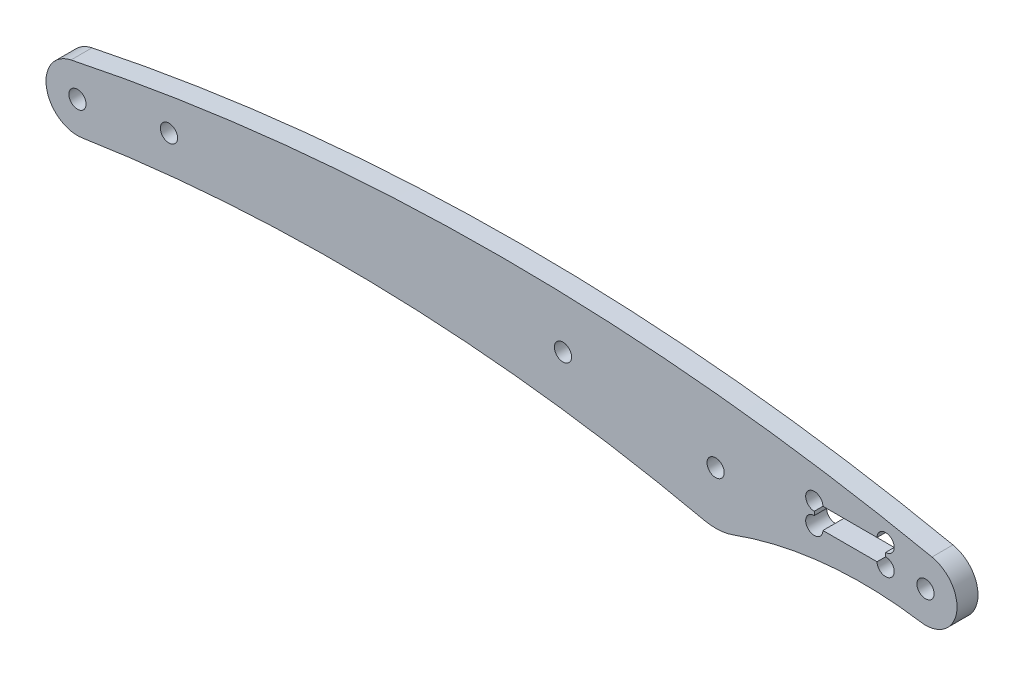
ISO-10303-21;
HEADER;
FILE_DESCRIPTION(('STEP AP214'),'2;1');
FILE_NAME('part.step','',(''),(''),'','','');
FILE_SCHEMA(('AUTOMOTIVE_DESIGN { 1 0 10303 214 1 1 1 1 }'));
ENDSEC;
DATA;
#1=APPLICATION_CONTEXT('core data for automotive mechanical design processes');
#2=APPLICATION_PROTOCOL_DEFINITION('international standard','automotive_design',2000,#1);
#3=PRODUCT_CONTEXT('',#1,'mechanical');
#4=PRODUCT('Part','Part','',(#3));
#5=PRODUCT_RELATED_PRODUCT_CATEGORY('part','',(#4));
#6=PRODUCT_DEFINITION_FORMATION('','',#4);
#7=PRODUCT_DEFINITION_CONTEXT('part definition',#1,'design');
#8=PRODUCT_DEFINITION('design','',#6,#7);
#9=PRODUCT_DEFINITION_SHAPE('','',#8);
#10=(LENGTH_UNIT() NAMED_UNIT(*) SI_UNIT(.MILLI.,.METRE.));
#11=(NAMED_UNIT(*) PLANE_ANGLE_UNIT() SI_UNIT($,.RADIAN.));
#12=(NAMED_UNIT(*) SI_UNIT($,.STERADIAN.) SOLID_ANGLE_UNIT());
#13=UNCERTAINTY_MEASURE_WITH_UNIT(LENGTH_MEASURE(1.E-05),#10,'distance_accuracy_value','');
#14=(GEOMETRIC_REPRESENTATION_CONTEXT(3) GLOBAL_UNCERTAINTY_ASSIGNED_CONTEXT((#13)) GLOBAL_UNIT_ASSIGNED_CONTEXT((#10,
#11,#12)) REPRESENTATION_CONTEXT('',''));
#15=CARTESIAN_POINT('',(0.,0.,0.));
#16=DIRECTION('',(0.,0.,1.));
#17=DIRECTION('',(1.,0.,0.));
#18=AXIS2_PLACEMENT_3D('',#15,#16,#17);
#19=CARTESIAN_POINT('',(31.2565789473684,-201.33824468418,5.));
#20=DIRECTION('',(0.,0.,1.));
#21=DIRECTION('',(1.,0.,0.));
#22=AXIS2_PLACEMENT_3D('',#19,#20,#21);
#23=PLANE('',#22);
#24=CARTESIAN_POINT('',(192.5,4.82060107798254,5.));
#25=DIRECTION('',(0.,0.,1.));
#26=DIRECTION('',(1.,0.,0.));
#27=AXIS2_PLACEMENT_3D('',#24,#25,#26);
#28=CIRCLE('',#27,2.04999999999999);
#29=CARTESIAN_POINT('',(192.5,2.77060107798255,5.));
#30=VERTEX_POINT('',#29);
#31=CARTESIAN_POINT('',(190.45,4.82060107798254,5.));
#32=VERTEX_POINT('',#31);
#33=EDGE_CURVE('E553',#30,#32,#28,.T.);
#34=ORIENTED_EDGE('',*,*,#33,.F.);
#35=DIRECTION('',(0.,1.,0.));
#36=VECTOR('',#35,1.);
#37=CARTESIAN_POINT('',(192.5,-0.179398922017457,5.));
#38=LINE('',#37,#36);
#39=CARTESIAN_POINT('',(192.5,1.87060107798254,5.));
#40=VERTEX_POINT('',#39);
#41=EDGE_CURVE('E176',#40,#30,#38,.T.);
#42=ORIENTED_EDGE('',*,*,#41,.F.);
#43=CARTESIAN_POINT('',(192.5,-0.179398922017457,5.));
#44=DIRECTION('',(0.,0.,1.));
#45=DIRECTION('',(1.,0.,0.));
#46=AXIS2_PLACEMENT_3D('',#43,#44,#45);
#47=CIRCLE('',#46,2.04999999999999);
#48=CARTESIAN_POINT('',(190.45,-0.179398922017457,5.));
#49=VERTEX_POINT('',#48);
#50=EDGE_CURVE('E544',#49,#40,#47,.T.);
#51=ORIENTED_EDGE('',*,*,#50,.F.);
#52=DIRECTION('',(1.,0.,0.));
#53=VECTOR('',#52,1.);
#54=CARTESIAN_POINT('',(175.5,-0.179398922017457,5.));
#55=LINE('',#54,#53);
#56=CARTESIAN_POINT('',(177.55,-0.179398922017457,5.));
#57=VERTEX_POINT('',#56);
#58=EDGE_CURVE('E167',#57,#49,#55,.T.);
#59=ORIENTED_EDGE('',*,*,#58,.F.);
#60=CARTESIAN_POINT('',(175.5,-0.17939892201746,5.));
#61=DIRECTION('',(0.,0.,1.));
#62=DIRECTION('',(1.,0.,0.));
#63=AXIS2_PLACEMENT_3D('',#60,#61,#62);
#64=CIRCLE('',#63,2.04999999999999);
#65=CARTESIAN_POINT('',(175.5,1.87060107798253,5.));
#66=VERTEX_POINT('',#65);
#67=EDGE_CURVE('E149',#66,#57,#64,.T.);
#68=ORIENTED_EDGE('',*,*,#67,.F.);
#69=DIRECTION('',(0.,-1.,0.));
#70=VECTOR('',#69,1.);
#71=CARTESIAN_POINT('',(175.5,-0.179398922017457,5.));
#72=LINE('',#71,#70);
#73=CARTESIAN_POINT('',(175.5,2.77060107798255,5.));
#74=VERTEX_POINT('',#73);
#75=EDGE_CURVE('E159',#74,#66,#72,.T.);
#76=ORIENTED_EDGE('',*,*,#75,.F.);
#77=CARTESIAN_POINT('',(175.5,4.82060107798254,5.));
#78=DIRECTION('',(0.,0.,1.));
#79=DIRECTION('',(1.,0.,0.));
#80=AXIS2_PLACEMENT_3D('',#77,#78,#79);
#81=CIRCLE('',#80,2.04999999999999);
#82=CARTESIAN_POINT('',(177.55,4.82060107798254,5.));
#83=VERTEX_POINT('',#82);
#84=EDGE_CURVE('E529',#83,#74,#81,.T.);
#85=ORIENTED_EDGE('',*,*,#84,.F.);
#86=DIRECTION('',(-1.,0.,0.));
#87=VECTOR('',#86,1.);
#88=CARTESIAN_POINT('',(175.5,4.82060107798254,5.));
#89=LINE('',#88,#87);
#90=EDGE_CURVE('E179',#32,#83,#89,.T.);
#91=ORIENTED_EDGE('',*,*,#90,.F.);
#92=EDGE_LOOP('',(#34,#42,#51,#59,#68,#76,#85,#91));
#93=FACE_BOUND('',#92,.T.);
#94=CARTESIAN_POINT('',(115.643522850796,5.67392586663605,5.));
#95=DIRECTION('',(0.,0.,1.));
#96=DIRECTION('',(1.,0.,0.));
#97=AXIS2_PLACEMENT_3D('',#94,#95,#96);
#98=CIRCLE('',#97,2.04999999999999);
#99=CARTESIAN_POINT('',(117.693522850796,5.67392586663605,5.));
#100=VERTEX_POINT('',#99);
#101=EDGE_CURVE('E184',#100,#100,#98,.T.);
#102=ORIENTED_EDGE('',*,*,#101,.F.);
#103=EDGE_LOOP('',(#102));
#104=FACE_BOUND('',#103,.T.);
#105=CARTESIAN_POINT('',(21.7926473493923,3.92392586663605,5.));
#106=DIRECTION('',(0.,0.,1.));
#107=DIRECTION('',(1.,0.,0.));
#108=AXIS2_PLACEMENT_3D('',#105,#106,#107);
#109=CIRCLE('',#108,2.05);
#110=CARTESIAN_POINT('',(23.8426473493923,3.92392586663605,5.));
#111=VERTEX_POINT('',#110);
#112=EDGE_CURVE('E187',#111,#111,#109,.T.);
#113=ORIENTED_EDGE('',*,*,#112,.F.);
#114=EDGE_LOOP('',(#113));
#115=FACE_BOUND('',#114,.T.);
#116=CARTESIAN_POINT('',(202.,0.,5.));
#117=DIRECTION('',(0.,0.,1.));
#118=DIRECTION('',(1.,0.,0.));
#119=AXIS2_PLACEMENT_3D('',#116,#117,#118);
#120=CIRCLE('',#119,2.04999999999999);
#121=CARTESIAN_POINT('',(204.05,0.,5.));
#122=VERTEX_POINT('',#121);
#123=EDGE_CURVE('E198',#122,#122,#120,.T.);
#124=ORIENTED_EDGE('',*,*,#123,.F.);
#125=EDGE_LOOP('',(#124));
#126=FACE_BOUND('',#125,.T.);
#127=CARTESIAN_POINT('',(62.5131578947368,-402.676489368361,5.));
#128=DIRECTION('',(0.,0.,-1.));
#129=DIRECTION('',(1.,0.,0.));
#130=AXIS2_PLACEMENT_3D('',#127,#128,#129);
#131=CIRCLE('',#130,400.);
#132=CARTESIAN_POINT('',(1.15054891830802,-7.4112237307059,5.));
#133=VERTEX_POINT('',#132);
#134=CARTESIAN_POINT('',(149.288277511962,-12.2023178596472,5.));
#135=VERTEX_POINT('',#134);
#136=EDGE_CURVE('E210',#133,#135,#131,.T.);
#137=ORIENTED_EDGE('',*,*,#136,.T.);
#138=CARTESIAN_POINT('',(152.,0.,5.));
#139=DIRECTION('',(0.,0.,1.));
#140=DIRECTION('',(1.,0.,0.));
#141=AXIS2_PLACEMENT_3D('',#138,#139,#140);
#142=CIRCLE('',#141,12.4999999999999);
#143=CARTESIAN_POINT('',(156.268292682927,-11.7486883341449,5.));
#144=VERTEX_POINT('',#143);
#145=EDGE_CURVE('E213',#135,#144,#142,.T.);
#146=ORIENTED_EDGE('',*,*,#145,.T.);
#147=CARTESIAN_POINT('',(187.,-96.3392443399884,5.));
#148=DIRECTION('',(0.,0.,-1.));
#149=DIRECTION('',(1.,0.,0.));
#150=AXIS2_PLACEMENT_3D('',#147,#148,#149);
#151=CIRCLE('',#150,90.);
#152=CARTESIAN_POINT('',(200.846153846154,-7.4107111030761,5.));
#153=VERTEX_POINT('',#152);
#154=EDGE_CURVE('E216',#144,#153,#151,.T.);
#155=ORIENTED_EDGE('',*,*,#154,.T.);
#156=CARTESIAN_POINT('',(202.,0.,5.));
#157=DIRECTION('',(0.,0.,1.));
#158=DIRECTION('',(1.,0.,0.));
#159=AXIS2_PLACEMENT_3D('',#156,#157,#158);
#160=CIRCLE('',#159,7.50000000000006);
#161=CARTESIAN_POINT('',(203.53807106599,7.34059516633123,5.));
#162=VERTEX_POINT('',#161);
#163=EDGE_CURVE('E218',#153,#162,#160,.T.);
#164=ORIENTED_EDGE('',*,*,#163,.T.);
#165=CARTESIAN_POINT('',(101.000000000001,-482.032415922415,5.));
#166=DIRECTION('',(0.,0.,1.));
#167=DIRECTION('',(1.,0.,0.));
#168=AXIS2_PLACEMENT_3D('',#165,#166,#167);
#169=CIRCLE('',#168,500.);
#170=CARTESIAN_POINT('',(-1.53807106598983,7.34059516633106,5.));
#171=VERTEX_POINT('',#170);
#172=EDGE_CURVE('E220',#162,#171,#169,.T.);
#173=ORIENTED_EDGE('',*,*,#172,.T.);
#174=CARTESIAN_POINT('',(0.,0.,5.));
#175=DIRECTION('',(0.,0.,1.));
#176=DIRECTION('',(1.,0.,0.));
#177=AXIS2_PLACEMENT_3D('',#174,#175,#176);
#178=CIRCLE('',#177,7.49999999999986);
#179=EDGE_CURVE('E222',#171,#133,#178,.T.);
#180=ORIENTED_EDGE('',*,*,#179,.T.);
#181=EDGE_LOOP('',(#137,#146,#155,#164,#173,#180));
#182=FACE_BOUND('',#181,.T.);
#183=CARTESIAN_POINT('',(0.,0.,5.));
#184=DIRECTION('',(0.,0.,1.));
#185=DIRECTION('',(1.,0.,0.));
#186=AXIS2_PLACEMENT_3D('',#183,#184,#185);
#187=CIRCLE('',#186,2.05);
#188=CARTESIAN_POINT('',(2.05,0.,5.));
#189=VERTEX_POINT('',#188);
#190=EDGE_CURVE('E204',#189,#189,#187,.T.);
#191=ORIENTED_EDGE('',*,*,#190,.F.);
#192=EDGE_LOOP('',(#191));
#193=FACE_BOUND('',#192,.T.);
#194=CARTESIAN_POINT('',(152.,0.,5.));
#195=DIRECTION('',(0.,0.,1.));
#196=DIRECTION('',(1.,0.,0.));
#197=AXIS2_PLACEMENT_3D('',#194,#195,#196);
#198=CIRCLE('',#197,2.04999999999999);
#199=CARTESIAN_POINT('',(154.05,0.,5.));
#200=VERTEX_POINT('',#199);
#201=EDGE_CURVE('E191',#200,#200,#198,.T.);
#202=ORIENTED_EDGE('',*,*,#201,.F.);
#203=EDGE_LOOP('',(#202));
#204=FACE_BOUND('',#203,.T.);
#205=ADVANCED_FACE('F36',(#93,#104,#115,#126,#182,#193,#204),#23,.T.);
#206=CARTESIAN_POINT('',(31.2565789473684,-201.33824468418,0.));
#207=DIRECTION('',(0.,0.,1.));
#208=DIRECTION('',(1.,0.,0.));
#209=AXIS2_PLACEMENT_3D('',#206,#207,#208);
#210=PLANE('',#209);
#211=DIRECTION('',(0.,-1.,0.));
#212=VECTOR('',#211,1.);
#213=CARTESIAN_POINT('',(192.5,-0.179398922017457,0.));
#214=LINE('',#213,#212);
#215=CARTESIAN_POINT('',(192.5,2.77060107798255,0.));
#216=VERTEX_POINT('',#215);
#217=CARTESIAN_POINT('',(192.5,1.87060107798254,0.));
#218=VERTEX_POINT('',#217);
#219=EDGE_CURVE('E170',#216,#218,#214,.T.);
#220=ORIENTED_EDGE('',*,*,#219,.F.);
#221=CARTESIAN_POINT('',(192.5,4.82060107798254,0.));
#222=DIRECTION('',(0.,0.,1.));
#223=DIRECTION('',(1.,0.,0.));
#224=AXIS2_PLACEMENT_3D('',#221,#222,#223);
#225=CIRCLE('',#224,2.04999999999999);
#226=CARTESIAN_POINT('',(190.45,4.82060107798254,0.));
#227=VERTEX_POINT('',#226);
#228=EDGE_CURVE('E61',#227,#216,#225,.F.);
#229=ORIENTED_EDGE('',*,*,#228,.F.);
#230=DIRECTION('',(1.,0.,0.));
#231=VECTOR('',#230,1.);
#232=CARTESIAN_POINT('',(175.5,4.82060107798254,0.));
#233=LINE('',#232,#231);
#234=CARTESIAN_POINT('',(177.55,4.82060107798254,0.));
#235=VERTEX_POINT('',#234);
#236=EDGE_CURVE('E165',#235,#227,#233,.T.);
#237=ORIENTED_EDGE('',*,*,#236,.F.);
#238=CARTESIAN_POINT('',(175.5,4.82060107798254,0.));
#239=DIRECTION('',(0.,0.,1.));
#240=DIRECTION('',(1.,0.,0.));
#241=AXIS2_PLACEMENT_3D('',#238,#239,#240);
#242=CIRCLE('',#241,2.04999999999999);
#243=CARTESIAN_POINT('',(175.5,2.77060107798255,0.));
#244=VERTEX_POINT('',#243);
#245=EDGE_CURVE('E53',#244,#235,#242,.F.);
#246=ORIENTED_EDGE('',*,*,#245,.F.);
#247=DIRECTION('',(0.,1.,0.));
#248=VECTOR('',#247,1.);
#249=CARTESIAN_POINT('',(175.5,-0.179398922017457,0.));
#250=LINE('',#249,#248);
#251=CARTESIAN_POINT('',(175.5,1.87060107798253,0.));
#252=VERTEX_POINT('',#251);
#253=EDGE_CURVE('E157',#252,#244,#250,.T.);
#254=ORIENTED_EDGE('',*,*,#253,.F.);
#255=CARTESIAN_POINT('',(175.5,-0.17939892201746,0.));
#256=DIRECTION('',(0.,0.,1.));
#257=DIRECTION('',(1.,0.,0.));
#258=AXIS2_PLACEMENT_3D('',#255,#256,#257);
#259=CIRCLE('',#258,2.04999999999999);
#260=CARTESIAN_POINT('',(177.55,-0.179398922017457,0.));
#261=VERTEX_POINT('',#260);
#262=EDGE_CURVE('E138',#261,#252,#259,.F.);
#263=ORIENTED_EDGE('',*,*,#262,.F.);
#264=DIRECTION('',(-1.,0.,0.));
#265=VECTOR('',#264,1.);
#266=CARTESIAN_POINT('',(175.5,-0.179398922017457,0.));
#267=LINE('',#266,#265);
#268=CARTESIAN_POINT('',(190.45,-0.179398922017457,0.));
#269=VERTEX_POINT('',#268);
#270=EDGE_CURVE('E182',#269,#261,#267,.T.);
#271=ORIENTED_EDGE('',*,*,#270,.F.);
#272=CARTESIAN_POINT('',(192.5,-0.179398922017457,0.));
#273=DIRECTION('',(0.,0.,1.));
#274=DIRECTION('',(1.,0.,0.));
#275=AXIS2_PLACEMENT_3D('',#272,#273,#274);
#276=CIRCLE('',#275,2.04999999999999);
#277=EDGE_CURVE('E542',#218,#269,#276,.F.);
#278=ORIENTED_EDGE('',*,*,#277,.F.);
#279=EDGE_LOOP('',(#220,#229,#237,#246,#254,#263,#271,#278));
#280=FACE_BOUND('',#279,.T.);
#281=CARTESIAN_POINT('',(115.643522850796,5.67392586663605,0.));
#282=DIRECTION('',(0.,0.,1.));
#283=DIRECTION('',(1.,0.,0.));
#284=AXIS2_PLACEMENT_3D('',#281,#282,#283);
#285=CIRCLE('',#284,2.04999999999999);
#286=CARTESIAN_POINT('',(117.693522850796,5.67392586663605,0.));
#287=VERTEX_POINT('',#286);
#288=EDGE_CURVE('E40',#287,#287,#285,.T.);
#289=ORIENTED_EDGE('',*,*,#288,.T.);
#290=EDGE_LOOP('',(#289));
#291=FACE_BOUND('',#290,.T.);
#292=CARTESIAN_POINT('',(21.7926473493923,3.92392586663605,0.));
#293=DIRECTION('',(0.,0.,1.));
#294=DIRECTION('',(1.,0.,0.));
#295=AXIS2_PLACEMENT_3D('',#292,#293,#294);
#296=CIRCLE('',#295,2.05);
#297=CARTESIAN_POINT('',(23.8426473493923,3.92392586663605,0.));
#298=VERTEX_POINT('',#297);
#299=EDGE_CURVE('E190',#298,#298,#296,.T.);
#300=ORIENTED_EDGE('',*,*,#299,.T.);
#301=EDGE_LOOP('',(#300));
#302=FACE_BOUND('',#301,.T.);
#303=CARTESIAN_POINT('',(62.5131578947368,-402.676489368361,0.));
#304=DIRECTION('',(0.,0.,-1.));
#305=DIRECTION('',(1.,0.,0.));
#306=AXIS2_PLACEMENT_3D('',#303,#304,#305);
#307=CIRCLE('',#306,400.);
#308=CARTESIAN_POINT('',(1.15054891830802,-7.4112237307059,0.));
#309=VERTEX_POINT('',#308);
#310=CARTESIAN_POINT('',(149.288277511962,-12.2023178596472,0.));
#311=VERTEX_POINT('',#310);
#312=EDGE_CURVE('E207',#309,#311,#307,.T.);
#313=ORIENTED_EDGE('',*,*,#312,.F.);
#314=CARTESIAN_POINT('',(0.,0.,0.));
#315=DIRECTION('',(0.,0.,1.));
#316=DIRECTION('',(1.,0.,0.));
#317=AXIS2_PLACEMENT_3D('',#314,#315,#316);
#318=CIRCLE('',#317,7.49999999999986);
#319=CARTESIAN_POINT('',(-1.53807106598983,7.34059516633106,0.));
#320=VERTEX_POINT('',#319);
#321=EDGE_CURVE('E214',#320,#309,#318,.T.);
#322=ORIENTED_EDGE('',*,*,#321,.F.);
#323=CARTESIAN_POINT('',(101.000000000001,-482.032415922415,0.));
#324=DIRECTION('',(0.,0.,1.));
#325=DIRECTION('',(1.,0.,0.));
#326=AXIS2_PLACEMENT_3D('',#323,#324,#325);
#327=CIRCLE('',#326,500.);
#328=CARTESIAN_POINT('',(203.53807106599,7.34059516633123,0.));
#329=VERTEX_POINT('',#328);
#330=EDGE_CURVE('E233',#329,#320,#327,.T.);
#331=ORIENTED_EDGE('',*,*,#330,.F.);
#332=CARTESIAN_POINT('',(202.,0.,0.));
#333=DIRECTION('',(0.,0.,1.));
#334=DIRECTION('',(1.,0.,0.));
#335=AXIS2_PLACEMENT_3D('',#332,#333,#334);
#336=CIRCLE('',#335,7.50000000000006);
#337=CARTESIAN_POINT('',(200.846153846154,-7.4107111030761,0.));
#338=VERTEX_POINT('',#337);
#339=EDGE_CURVE('E231',#338,#329,#336,.T.);
#340=ORIENTED_EDGE('',*,*,#339,.F.);
#341=CARTESIAN_POINT('',(187.,-96.3392443399884,0.));
#342=DIRECTION('',(0.,0.,-1.));
#343=DIRECTION('',(1.,0.,0.));
#344=AXIS2_PLACEMENT_3D('',#341,#342,#343);
#345=CIRCLE('',#344,90.);
#346=CARTESIAN_POINT('',(156.268292682927,-11.7486883341449,0.));
#347=VERTEX_POINT('',#346);
#348=EDGE_CURVE('E229',#347,#338,#345,.T.);
#349=ORIENTED_EDGE('',*,*,#348,.F.);
#350=CARTESIAN_POINT('',(152.,0.,0.));
#351=DIRECTION('',(0.,0.,1.));
#352=DIRECTION('',(1.,0.,0.));
#353=AXIS2_PLACEMENT_3D('',#350,#351,#352);
#354=CIRCLE('',#353,12.4999999999999);
#355=EDGE_CURVE('E227',#311,#347,#354,.T.);
#356=ORIENTED_EDGE('',*,*,#355,.F.);
#357=EDGE_LOOP('',(#313,#322,#331,#340,#349,#356));
#358=FACE_BOUND('',#357,.T.);
#359=CARTESIAN_POINT('',(0.,0.,0.));
#360=DIRECTION('',(0.,0.,1.));
#361=DIRECTION('',(1.,0.,0.));
#362=AXIS2_PLACEMENT_3D('',#359,#360,#361);
#363=CIRCLE('',#362,2.05);
#364=CARTESIAN_POINT('',(2.05,0.,0.));
#365=VERTEX_POINT('',#364);
#366=EDGE_CURVE('E201',#365,#365,#363,.T.);
#367=ORIENTED_EDGE('',*,*,#366,.T.);
#368=EDGE_LOOP('',(#367));
#369=FACE_BOUND('',#368,.T.);
#370=CARTESIAN_POINT('',(202.,0.,0.));
#371=DIRECTION('',(0.,0.,1.));
#372=DIRECTION('',(1.,0.,0.));
#373=AXIS2_PLACEMENT_3D('',#370,#371,#372);
#374=CIRCLE('',#373,2.04999999999999);
#375=CARTESIAN_POINT('',(204.05,0.,0.));
#376=VERTEX_POINT('',#375);
#377=EDGE_CURVE('E194',#376,#376,#374,.T.);
#378=ORIENTED_EDGE('',*,*,#377,.T.);
#379=EDGE_LOOP('',(#378));
#380=FACE_BOUND('',#379,.T.);
#381=CARTESIAN_POINT('',(152.,0.,0.));
#382=DIRECTION('',(0.,0.,1.));
#383=DIRECTION('',(1.,0.,0.));
#384=AXIS2_PLACEMENT_3D('',#381,#382,#383);
#385=CIRCLE('',#384,2.04999999999999);
#386=CARTESIAN_POINT('',(154.05,0.,0.));
#387=VERTEX_POINT('',#386);
#388=EDGE_CURVE('E195',#387,#387,#385,.T.);
#389=ORIENTED_EDGE('',*,*,#388,.T.);
#390=EDGE_LOOP('',(#389));
#391=FACE_BOUND('',#390,.T.);
#392=ADVANCED_FACE('F162',(#280,#291,#302,#358,#369,#380,#391),#210,.F.);
#393=CARTESIAN_POINT('',(62.5131578947368,-402.676489368361,5.));
#394=DIRECTION('',(0.,0.,-1.));
#395=DIRECTION('',(-1.,0.,0.));
#396=AXIS2_PLACEMENT_3D('',#393,#394,#395);
#397=CYLINDRICAL_SURFACE('',#396,400.);
#398=ORIENTED_EDGE('',*,*,#312,.T.);
#399=DIRECTION('',(0.,0.,-1.));
#400=VECTOR('',#399,1.);
#401=CARTESIAN_POINT('',(149.288277511962,-12.2023178596472,5.));
#402=LINE('',#401,#400);
#403=EDGE_CURVE('E11',#135,#311,#402,.T.);
#404=ORIENTED_EDGE('',*,*,#403,.F.);
#405=ORIENTED_EDGE('',*,*,#136,.F.);
#406=DIRECTION('',(0.,0.,-1.));
#407=VECTOR('',#406,1.);
#408=CARTESIAN_POINT('',(1.15054891830802,-7.4112237307059,5.));
#409=LINE('',#408,#407);
#410=EDGE_CURVE('E224',#133,#309,#409,.T.);
#411=ORIENTED_EDGE('',*,*,#410,.T.);
#412=EDGE_LOOP('',(#398,#404,#405,#411));
#413=FACE_BOUND('',#412,.T.);
#414=ADVANCED_FACE('F38',(#413),#397,.F.);
#415=CARTESIAN_POINT('',(152.,0.,5.));
#416=DIRECTION('',(0.,0.,-1.));
#417=DIRECTION('',(-1.,0.,0.));
#418=AXIS2_PLACEMENT_3D('',#415,#416,#417);
#419=CYLINDRICAL_SURFACE('',#418,12.4999999999999);
#420=ORIENTED_EDGE('',*,*,#355,.T.);
#421=DIRECTION('',(0.,0.,-1.));
#422=VECTOR('',#421,1.);
#423=CARTESIAN_POINT('',(156.268292682927,-11.7486883341449,5.));
#424=LINE('',#423,#422);
#425=EDGE_CURVE('E45',#144,#347,#424,.T.);
#426=ORIENTED_EDGE('',*,*,#425,.F.);
#427=ORIENTED_EDGE('',*,*,#145,.F.);
#428=ORIENTED_EDGE('',*,*,#403,.T.);
#429=EDGE_LOOP('',(#420,#426,#427,#428));
#430=FACE_BOUND('',#429,.T.);
#431=ADVANCED_FACE('F295',(#430),#419,.T.);
#432=CARTESIAN_POINT('',(187.,-96.3392443399884,5.));
#433=DIRECTION('',(0.,0.,-1.));
#434=DIRECTION('',(-1.,0.,0.));
#435=AXIS2_PLACEMENT_3D('',#432,#433,#434);
#436=CYLINDRICAL_SURFACE('',#435,90.);
#437=ORIENTED_EDGE('',*,*,#348,.T.);
#438=DIRECTION('',(0.,0.,-1.));
#439=VECTOR('',#438,1.);
#440=CARTESIAN_POINT('',(200.846153846154,-7.4107111030761,5.));
#441=LINE('',#440,#439);
#442=EDGE_CURVE('E244',#153,#338,#441,.T.);
#443=ORIENTED_EDGE('',*,*,#442,.F.);
#444=ORIENTED_EDGE('',*,*,#154,.F.);
#445=ORIENTED_EDGE('',*,*,#425,.T.);
#446=EDGE_LOOP('',(#437,#443,#444,#445));
#447=FACE_BOUND('',#446,.T.);
#448=ADVANCED_FACE('F292',(#447),#436,.F.);
#449=CARTESIAN_POINT('',(202.,0.,5.));
#450=DIRECTION('',(0.,0.,-1.));
#451=DIRECTION('',(-1.,0.,0.));
#452=AXIS2_PLACEMENT_3D('',#449,#450,#451);
#453=CYLINDRICAL_SURFACE('',#452,7.50000000000006);
#454=ORIENTED_EDGE('',*,*,#339,.T.);
#455=DIRECTION('',(0.,0.,-1.));
#456=VECTOR('',#455,1.);
#457=CARTESIAN_POINT('',(203.53807106599,7.34059516633123,5.));
#458=LINE('',#457,#456);
#459=EDGE_CURVE('E241',#162,#329,#458,.T.);
#460=ORIENTED_EDGE('',*,*,#459,.F.);
#461=ORIENTED_EDGE('',*,*,#163,.F.);
#462=ORIENTED_EDGE('',*,*,#442,.T.);
#463=EDGE_LOOP('',(#454,#460,#461,#462));
#464=FACE_BOUND('',#463,.T.);
#465=ADVANCED_FACE('F288',(#464),#453,.T.);
#466=CARTESIAN_POINT('',(101.000000000001,-482.032415922415,5.));
#467=DIRECTION('',(0.,0.,-1.));
#468=DIRECTION('',(-1.,0.,0.));
#469=AXIS2_PLACEMENT_3D('',#466,#467,#468);
#470=CYLINDRICAL_SURFACE('',#469,500.);
#471=ORIENTED_EDGE('',*,*,#330,.T.);
#472=DIRECTION('',(0.,0.,-1.));
#473=VECTOR('',#472,1.);
#474=CARTESIAN_POINT('',(-1.53807106598983,7.34059516633106,5.));
#475=LINE('',#474,#473);
#476=EDGE_CURVE('E238',#171,#320,#475,.T.);
#477=ORIENTED_EDGE('',*,*,#476,.F.);
#478=ORIENTED_EDGE('',*,*,#172,.F.);
#479=ORIENTED_EDGE('',*,*,#459,.T.);
#480=EDGE_LOOP('',(#471,#477,#478,#479));
#481=FACE_BOUND('',#480,.T.);
#482=ADVANCED_FACE('F284',(#481),#470,.T.);
#483=CARTESIAN_POINT('',(0.,0.,5.));
#484=DIRECTION('',(0.,0.,-1.));
#485=DIRECTION('',(-1.,0.,0.));
#486=AXIS2_PLACEMENT_3D('',#483,#484,#485);
#487=CYLINDRICAL_SURFACE('',#486,7.49999999999986);
#488=ORIENTED_EDGE('',*,*,#321,.T.);
#489=ORIENTED_EDGE('',*,*,#410,.F.);
#490=ORIENTED_EDGE('',*,*,#179,.F.);
#491=ORIENTED_EDGE('',*,*,#476,.T.);
#492=EDGE_LOOP('',(#488,#489,#490,#491));
#493=FACE_BOUND('',#492,.T.);
#494=ADVANCED_FACE('F281',(#493),#487,.T.);
#495=CARTESIAN_POINT('',(0.,0.,5.));
#496=DIRECTION('',(0.,0.,-1.));
#497=DIRECTION('',(-1.,0.,0.));
#498=AXIS2_PLACEMENT_3D('',#495,#496,#497);
#499=CYLINDRICAL_SURFACE('',#498,2.05);
#500=ORIENTED_EDGE('',*,*,#190,.T.);
#501=EDGE_LOOP('',(#500));
#502=FACE_BOUND('',#501,.T.);
#503=ORIENTED_EDGE('',*,*,#366,.F.);
#504=EDGE_LOOP('',(#503));
#505=FACE_BOUND('',#504,.T.);
#506=ADVANCED_FACE('F278',(#502,#505),#499,.F.);
#507=CARTESIAN_POINT('',(202.,0.,5.));
#508=DIRECTION('',(0.,0.,-1.));
#509=DIRECTION('',(-1.,0.,0.));
#510=AXIS2_PLACEMENT_3D('',#507,#508,#509);
#511=CYLINDRICAL_SURFACE('',#510,2.04999999999999);
#512=ORIENTED_EDGE('',*,*,#123,.T.);
#513=EDGE_LOOP('',(#512));
#514=FACE_BOUND('',#513,.T.);
#515=ORIENTED_EDGE('',*,*,#377,.F.);
#516=EDGE_LOOP('',(#515));
#517=FACE_BOUND('',#516,.T.);
#518=ADVANCED_FACE('F265',(#514,#517),#511,.F.);
#519=CARTESIAN_POINT('',(152.,0.,5.));
#520=DIRECTION('',(0.,0.,-1.));
#521=DIRECTION('',(-1.,0.,0.));
#522=AXIS2_PLACEMENT_3D('',#519,#520,#521);
#523=CYLINDRICAL_SURFACE('',#522,2.04999999999999);
#524=ORIENTED_EDGE('',*,*,#201,.T.);
#525=EDGE_LOOP('',(#524));
#526=FACE_BOUND('',#525,.T.);
#527=ORIENTED_EDGE('',*,*,#388,.F.);
#528=EDGE_LOOP('',(#527));
#529=FACE_BOUND('',#528,.T.);
#530=ADVANCED_FACE('F256',(#526,#529),#523,.F.);
#531=CARTESIAN_POINT('',(21.7926473493923,3.92392586663605,-5.));
#532=DIRECTION('',(0.,0.,1.));
#533=DIRECTION('',(1.,0.,0.));
#534=AXIS2_PLACEMENT_3D('',#531,#532,#533);
#535=CYLINDRICAL_SURFACE('',#534,2.05);
#536=ORIENTED_EDGE('',*,*,#112,.T.);
#537=EDGE_LOOP('',(#536));
#538=FACE_BOUND('',#537,.T.);
#539=ORIENTED_EDGE('',*,*,#299,.F.);
#540=EDGE_LOOP('',(#539));
#541=FACE_BOUND('',#540,.T.);
#542=ADVANCED_FACE('F253',(#538,#541),#535,.F.);
#543=CARTESIAN_POINT('',(115.643522850796,5.67392586663605,-5.));
#544=DIRECTION('',(0.,0.,1.));
#545=DIRECTION('',(1.,0.,0.));
#546=AXIS2_PLACEMENT_3D('',#543,#544,#545);
#547=CYLINDRICAL_SURFACE('',#546,2.04999999999999);
#548=ORIENTED_EDGE('',*,*,#101,.T.);
#549=EDGE_LOOP('',(#548));
#550=FACE_BOUND('',#549,.T.);
#551=ORIENTED_EDGE('',*,*,#288,.F.);
#552=EDGE_LOOP('',(#551));
#553=FACE_BOUND('',#552,.T.);
#554=ADVANCED_FACE('F255',(#550,#553),#547,.F.);
#555=CARTESIAN_POINT('',(175.5,-0.179398922017457,-0.00100000000000013));
#556=DIRECTION('',(-1.,0.,0.));
#557=DIRECTION('',(0.,0.,1.));
#558=AXIS2_PLACEMENT_3D('',#555,#556,#557);
#559=PLANE('',#558);
#560=ORIENTED_EDGE('',*,*,#75,.T.);
#561=DIRECTION('',(0.,0.,1.));
#562=VECTOR('',#561,1.);
#563=CARTESIAN_POINT('',(175.5,1.87060107798253,-0.00100000000000013));
#564=LINE('',#563,#562);
#565=EDGE_CURVE('E141',#252,#66,#564,.T.);
#566=ORIENTED_EDGE('',*,*,#565,.F.);
#567=ORIENTED_EDGE('',*,*,#253,.T.);
#568=DIRECTION('',(0.,0.,1.));
#569=VECTOR('',#568,1.);
#570=CARTESIAN_POINT('',(175.5,2.77060107798255,-0.00100000000000013));
#571=LINE('',#570,#569);
#572=EDGE_CURVE('E527',#74,#244,#571,.F.);
#573=ORIENTED_EDGE('',*,*,#572,.F.);
#574=EDGE_LOOP('',(#560,#566,#567,#573));
#575=FACE_BOUND('',#574,.T.);
#576=ADVANCED_FACE('F155',(#575),#559,.F.);
#577=CARTESIAN_POINT('',(175.5,4.82060107798254,-0.00100000000000013));
#578=DIRECTION('',(0.,1.,0.));
#579=DIRECTION('',(0.,0.,1.));
#580=AXIS2_PLACEMENT_3D('',#577,#578,#579);
#581=PLANE('',#580);
#582=ORIENTED_EDGE('',*,*,#236,.T.);
#583=DIRECTION('',(0.,0.,1.));
#584=VECTOR('',#583,1.);
#585=CARTESIAN_POINT('',(190.45,4.82060107798254,-0.00100000000000013));
#586=LINE('',#585,#584);
#587=EDGE_CURVE('E547',#32,#227,#586,.F.);
#588=ORIENTED_EDGE('',*,*,#587,.F.);
#589=ORIENTED_EDGE('',*,*,#90,.T.);
#590=DIRECTION('',(0.,0.,1.));
#591=VECTOR('',#590,1.);
#592=CARTESIAN_POINT('',(177.55,4.82060107798254,-0.00100000000000013));
#593=LINE('',#592,#591);
#594=EDGE_CURVE('E530',#235,#83,#593,.T.);
#595=ORIENTED_EDGE('',*,*,#594,.F.);
#596=EDGE_LOOP('',(#582,#588,#589,#595));
#597=FACE_BOUND('',#596,.T.);
#598=ADVANCED_FACE('F382',(#597),#581,.F.);
#599=CARTESIAN_POINT('',(192.5,-0.179398922017457,-0.00100000000000013));
#600=DIRECTION('',(1.,0.,0.));
#601=DIRECTION('',(0.,0.,-1.));
#602=AXIS2_PLACEMENT_3D('',#599,#600,#601);
#603=PLANE('',#602);
#604=ORIENTED_EDGE('',*,*,#41,.T.);
#605=DIRECTION('',(0.,0.,1.));
#606=VECTOR('',#605,1.);
#607=CARTESIAN_POINT('',(192.5,2.77060107798255,-0.00100000000000013));
#608=LINE('',#607,#606);
#609=EDGE_CURVE('E540',#216,#30,#608,.T.);
#610=ORIENTED_EDGE('',*,*,#609,.F.);
#611=ORIENTED_EDGE('',*,*,#219,.T.);
#612=DIRECTION('',(0.,0.,1.));
#613=VECTOR('',#612,1.);
#614=CARTESIAN_POINT('',(192.5,1.87060107798254,-0.00100000000000013));
#615=LINE('',#614,#613);
#616=EDGE_CURVE('E538',#40,#218,#615,.F.);
#617=ORIENTED_EDGE('',*,*,#616,.F.);
#618=EDGE_LOOP('',(#604,#610,#611,#617));
#619=FACE_BOUND('',#618,.T.);
#620=ADVANCED_FACE('F392',(#619),#603,.F.);
#621=CARTESIAN_POINT('',(175.5,-0.179398922017457,-0.00100000000000013));
#622=DIRECTION('',(0.,-1.,0.));
#623=DIRECTION('',(0.,0.,-1.));
#624=AXIS2_PLACEMENT_3D('',#621,#622,#623);
#625=PLANE('',#624);
#626=ORIENTED_EDGE('',*,*,#58,.T.);
#627=DIRECTION('',(0.,0.,1.));
#628=VECTOR('',#627,1.);
#629=CARTESIAN_POINT('',(190.45,-0.179398922017457,-0.00100000000000013));
#630=LINE('',#629,#628);
#631=EDGE_CURVE('E150',#269,#49,#630,.T.);
#632=ORIENTED_EDGE('',*,*,#631,.F.);
#633=ORIENTED_EDGE('',*,*,#270,.T.);
#634=DIRECTION('',(0.,0.,1.));
#635=VECTOR('',#634,1.);
#636=CARTESIAN_POINT('',(177.55,-0.179398922017457,-0.00100000000000013));
#637=LINE('',#636,#635);
#638=EDGE_CURVE('E144',#57,#261,#637,.F.);
#639=ORIENTED_EDGE('',*,*,#638,.F.);
#640=EDGE_LOOP('',(#626,#632,#633,#639));
#641=FACE_BOUND('',#640,.T.);
#642=ADVANCED_FACE('F403',(#641),#625,.F.);
#643=CARTESIAN_POINT('',(175.5,-0.17939892201746,-0.00100000000000013));
#644=DIRECTION('',(0.,0.,1.));
#645=DIRECTION('',(1.,0.,0.));
#646=AXIS2_PLACEMENT_3D('',#643,#644,#645);
#647=CYLINDRICAL_SURFACE('',#646,2.04999999999999);
#648=ORIENTED_EDGE('',*,*,#565,.T.);
#649=ORIENTED_EDGE('',*,*,#67,.T.);
#650=ORIENTED_EDGE('',*,*,#638,.T.);
#651=ORIENTED_EDGE('',*,*,#262,.T.);
#652=EDGE_LOOP('',(#648,#649,#650,#651));
#653=FACE_BOUND('',#652,.T.);
#654=ADVANCED_FACE('F140',(#653),#647,.F.);
#655=CARTESIAN_POINT('',(192.5,-0.179398922017457,-0.00100000000000013));
#656=DIRECTION('',(0.,0.,1.));
#657=DIRECTION('',(1.,0.,0.));
#658=AXIS2_PLACEMENT_3D('',#655,#656,#657);
#659=CYLINDRICAL_SURFACE('',#658,2.04999999999999);
#660=ORIENTED_EDGE('',*,*,#616,.T.);
#661=ORIENTED_EDGE('',*,*,#277,.T.);
#662=ORIENTED_EDGE('',*,*,#631,.T.);
#663=ORIENTED_EDGE('',*,*,#50,.T.);
#664=EDGE_LOOP('',(#660,#661,#662,#663));
#665=FACE_BOUND('',#664,.T.);
#666=ADVANCED_FACE('F424',(#665),#659,.F.);
#667=CARTESIAN_POINT('',(192.5,4.82060107798254,-0.00100000000000013));
#668=DIRECTION('',(0.,0.,1.));
#669=DIRECTION('',(1.,0.,0.));
#670=AXIS2_PLACEMENT_3D('',#667,#668,#669);
#671=CYLINDRICAL_SURFACE('',#670,2.04999999999999);
#672=ORIENTED_EDGE('',*,*,#587,.T.);
#673=ORIENTED_EDGE('',*,*,#228,.T.);
#674=ORIENTED_EDGE('',*,*,#609,.T.);
#675=ORIENTED_EDGE('',*,*,#33,.T.);
#676=EDGE_LOOP('',(#672,#673,#674,#675));
#677=FACE_BOUND('',#676,.T.);
#678=ADVANCED_FACE('F434',(#677),#671,.F.);
#679=CARTESIAN_POINT('',(175.5,4.82060107798254,-0.00100000000000013));
#680=DIRECTION('',(0.,0.,1.));
#681=DIRECTION('',(1.,0.,0.));
#682=AXIS2_PLACEMENT_3D('',#679,#680,#681);
#683=CYLINDRICAL_SURFACE('',#682,2.04999999999999);
#684=ORIENTED_EDGE('',*,*,#572,.T.);
#685=ORIENTED_EDGE('',*,*,#245,.T.);
#686=ORIENTED_EDGE('',*,*,#594,.T.);
#687=ORIENTED_EDGE('',*,*,#84,.T.);
#688=EDGE_LOOP('',(#684,#685,#686,#687));
#689=FACE_BOUND('',#688,.T.);
#690=ADVANCED_FACE('F445',(#689),#683,.F.);
#691=CLOSED_SHELL('',(#205,#392,#414,#431,#448,#465,#482,#494,#506,#518,#530,#542,#554,#576,
#598,#620,#642,#654,#666,#678,#690));
#692=MANIFOLD_SOLID_BREP('B2',#691);
#693=ADVANCED_BREP_SHAPE_REPRESENTATION('',(#18,#692),#14);
#694=SHAPE_DEFINITION_REPRESENTATION(#9,#693);
ENDSEC;
END-ISO-10303-21;
